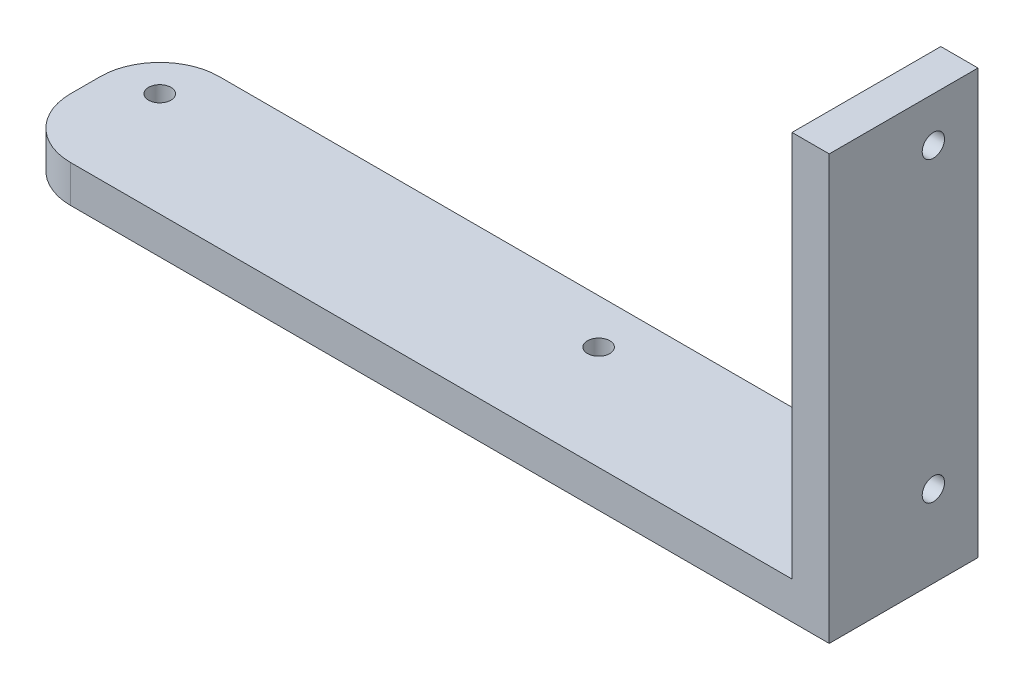
ISO-10303-21;
HEADER;
FILE_DESCRIPTION(('STEP AP214'),'2;1');
FILE_NAME('part.step','',(''),(''),'','','');
FILE_SCHEMA(('AUTOMOTIVE_DESIGN { 1 0 10303 214 1 1 1 1 }'));
ENDSEC;
DATA;
#1=APPLICATION_CONTEXT('core data for automotive mechanical design processes');
#2=APPLICATION_PROTOCOL_DEFINITION('international standard','automotive_design',2000,#1);
#3=PRODUCT_CONTEXT('',#1,'mechanical');
#4=PRODUCT('Part','Part','',(#3));
#5=PRODUCT_RELATED_PRODUCT_CATEGORY('part','',(#4));
#6=PRODUCT_DEFINITION_FORMATION('','',#4);
#7=PRODUCT_DEFINITION_CONTEXT('part definition',#1,'design');
#8=PRODUCT_DEFINITION('design','',#6,#7);
#9=PRODUCT_DEFINITION_SHAPE('','',#8);
#10=(LENGTH_UNIT() NAMED_UNIT(*) SI_UNIT(.MILLI.,.METRE.));
#11=(NAMED_UNIT(*) PLANE_ANGLE_UNIT() SI_UNIT($,.RADIAN.));
#12=(NAMED_UNIT(*) SI_UNIT($,.STERADIAN.) SOLID_ANGLE_UNIT());
#13=UNCERTAINTY_MEASURE_WITH_UNIT(LENGTH_MEASURE(1.E-05),#10,'distance_accuracy_value','');
#14=(GEOMETRIC_REPRESENTATION_CONTEXT(3) GLOBAL_UNCERTAINTY_ASSIGNED_CONTEXT((#13)) GLOBAL_UNIT_ASSIGNED_CONTEXT((#10,
#11,#12)) REPRESENTATION_CONTEXT('',''));
#15=CARTESIAN_POINT('',(0.,0.,0.));
#16=DIRECTION('',(0.,0.,1.));
#17=DIRECTION('',(1.,0.,0.));
#18=AXIS2_PLACEMENT_3D('',#15,#16,#17);
#19=CARTESIAN_POINT('',(0.,5.,0.));
#20=DIRECTION('',(0.,-1.,0.));
#21=DIRECTION('',(0.,0.,-1.));
#22=AXIS2_PLACEMENT_3D('',#19,#20,#21);
#23=PLANE('',#22);
#24=CARTESIAN_POINT('',(65.,5.,-14.));
#25=DIRECTION('',(0.,1.,0.));
#26=DIRECTION('',(0.,0.,1.));
#27=AXIS2_PLACEMENT_3D('',#24,#25,#26);
#28=CIRCLE('',#27,1.5);
#29=CARTESIAN_POINT('',(65.,5.,-12.5));
#30=VERTEX_POINT('',#29);
#31=EDGE_CURVE('E261',#30,#30,#28,.T.);
#32=ORIENTED_EDGE('',*,*,#31,.F.);
#33=EDGE_LOOP('',(#32));
#34=FACE_BOUND('',#33,.T.);
#35=CARTESIAN_POINT('',(6.00000000000001,5.,-14.));
#36=DIRECTION('',(0.,1.,0.));
#37=DIRECTION('',(0.,0.,1.));
#38=AXIS2_PLACEMENT_3D('',#35,#36,#37);
#39=CIRCLE('',#38,1.5);
#40=CARTESIAN_POINT('',(6.00000000000001,5.,-12.5));
#41=VERTEX_POINT('',#40);
#42=EDGE_CURVE('E132',#41,#41,#39,.T.);
#43=ORIENTED_EDGE('',*,*,#42,.F.);
#44=EDGE_LOOP('',(#43));
#45=FACE_BOUND('',#44,.T.);
#46=DIRECTION('',(-1.,0.,0.));
#47=VECTOR('',#46,1.);
#48=CARTESIAN_POINT('',(0.,5.,-20.));
#49=LINE('',#48,#47);
#50=CARTESIAN_POINT('',(105.,5.,-20.));
#51=VERTEX_POINT('',#50);
#52=CARTESIAN_POINT('',(8.,5.,-20.));
#53=VERTEX_POINT('',#52);
#54=EDGE_CURVE('E111',#51,#53,#49,.T.);
#55=ORIENTED_EDGE('',*,*,#54,.T.);
#56=CARTESIAN_POINT('',(8.,5.,-12.));
#57=DIRECTION('',(0.,-1.,0.));
#58=DIRECTION('',(0.,0.,-1.));
#59=AXIS2_PLACEMENT_3D('',#56,#57,#58);
#60=CIRCLE('',#59,8.);
#61=CARTESIAN_POINT('',(0.,5.,-12.));
#62=VERTEX_POINT('',#61);
#63=EDGE_CURVE('E41',#53,#62,#60,.F.);
#64=ORIENTED_EDGE('',*,*,#63,.T.);
#65=DIRECTION('',(0.,0.,1.));
#66=VECTOR('',#65,1.);
#67=CARTESIAN_POINT('',(0.,5.,0.));
#68=LINE('',#67,#66);
#69=CARTESIAN_POINT('',(0.,5.,-8.));
#70=VERTEX_POINT('',#69);
#71=EDGE_CURVE('E140',#62,#70,#68,.T.);
#72=ORIENTED_EDGE('',*,*,#71,.T.);
#73=CARTESIAN_POINT('',(8.,5.,-8.));
#74=DIRECTION('',(0.,-1.,0.));
#75=DIRECTION('',(0.,0.,-1.));
#76=AXIS2_PLACEMENT_3D('',#73,#74,#75);
#77=CIRCLE('',#76,8.);
#78=CARTESIAN_POINT('',(8.,5.,0.));
#79=VERTEX_POINT('',#78);
#80=EDGE_CURVE('E48',#70,#79,#77,.F.);
#81=ORIENTED_EDGE('',*,*,#80,.T.);
#82=DIRECTION('',(1.,0.,0.));
#83=VECTOR('',#82,1.);
#84=CARTESIAN_POINT('',(0.,5.,0.));
#85=LINE('',#84,#83);
#86=CARTESIAN_POINT('',(105.,5.,0.));
#87=VERTEX_POINT('',#86);
#88=EDGE_CURVE('E164',#79,#87,#85,.T.);
#89=ORIENTED_EDGE('',*,*,#88,.T.);
#90=DIRECTION('',(0.,0.,1.));
#91=VECTOR('',#90,1.);
#92=CARTESIAN_POINT('',(105.,5.,0.));
#93=LINE('',#92,#91);
#94=EDGE_CURVE('E126',#51,#87,#93,.T.);
#95=ORIENTED_EDGE('',*,*,#94,.F.);
#96=EDGE_LOOP('',(#55,#64,#72,#81,#89,#95));
#97=FACE_BOUND('',#96,.T.);
#98=ADVANCED_FACE('F33',(#34,#45,#97),#23,.F.);
#99=CARTESIAN_POINT('',(0.,5.,0.));
#100=DIRECTION('',(1.,0.,0.));
#101=DIRECTION('',(0.,0.,-1.));
#102=AXIS2_PLACEMENT_3D('',#99,#100,#101);
#103=PLANE('',#102);
#104=ORIENTED_EDGE('',*,*,#71,.F.);
#105=DIRECTION('',(0.,-1.,0.));
#106=VECTOR('',#105,1.);
#107=CARTESIAN_POINT('',(0.,5.,-12.));
#108=LINE('',#107,#106);
#109=CARTESIAN_POINT('',(0.,0.,-12.));
#110=VERTEX_POINT('',#109);
#111=EDGE_CURVE('E156',#62,#110,#108,.T.);
#112=ORIENTED_EDGE('',*,*,#111,.T.);
#113=DIRECTION('',(0.,0.,1.));
#114=VECTOR('',#113,1.);
#115=CARTESIAN_POINT('',(0.,0.,0.));
#116=LINE('',#115,#114);
#117=CARTESIAN_POINT('',(0.,0.,-8.));
#118=VERTEX_POINT('',#117);
#119=EDGE_CURVE('E151',#110,#118,#116,.T.);
#120=ORIENTED_EDGE('',*,*,#119,.T.);
#121=DIRECTION('',(0.,-1.,0.));
#122=VECTOR('',#121,1.);
#123=CARTESIAN_POINT('',(0.,5.,-8.));
#124=LINE('',#123,#122);
#125=EDGE_CURVE('E154',#118,#70,#124,.F.);
#126=ORIENTED_EDGE('',*,*,#125,.T.);
#127=EDGE_LOOP('',(#104,#112,#120,#126));
#128=FACE_BOUND('',#127,.T.);
#129=ADVANCED_FACE('F186',(#128),#103,.F.);
#130=CARTESIAN_POINT('',(0.,5.,0.));
#131=DIRECTION('',(0.,0.,-1.));
#132=DIRECTION('',(-1.,0.,0.));
#133=AXIS2_PLACEMENT_3D('',#130,#131,#132);
#134=PLANE('',#133);
#135=ORIENTED_EDGE('',*,*,#88,.F.);
#136=DIRECTION('',(0.,-1.,0.));
#137=VECTOR('',#136,1.);
#138=CARTESIAN_POINT('',(8.,5.,0.));
#139=LINE('',#138,#137);
#140=CARTESIAN_POINT('',(8.,0.,0.));
#141=VERTEX_POINT('',#140);
#142=EDGE_CURVE('E11',#79,#141,#139,.T.);
#143=ORIENTED_EDGE('',*,*,#142,.T.);
#144=DIRECTION('',(1.,0.,0.));
#145=VECTOR('',#144,1.);
#146=CARTESIAN_POINT('',(0.,0.,0.));
#147=LINE('',#146,#145);
#148=CARTESIAN_POINT('',(110.,0.,0.));
#149=VERTEX_POINT('',#148);
#150=EDGE_CURVE('E171',#141,#149,#147,.T.);
#151=ORIENTED_EDGE('',*,*,#150,.T.);
#152=DIRECTION('',(0.,-1.,0.));
#153=VECTOR('',#152,1.);
#154=CARTESIAN_POINT('',(110.,5.,0.));
#155=LINE('',#154,#153);
#156=CARTESIAN_POINT('',(110.,57.,0.));
#157=VERTEX_POINT('',#156);
#158=EDGE_CURVE('E110',#157,#149,#155,.T.);
#159=ORIENTED_EDGE('',*,*,#158,.F.);
#160=DIRECTION('',(1.,0.,0.));
#161=VECTOR('',#160,1.);
#162=CARTESIAN_POINT('',(110.,57.,0.));
#163=LINE('',#162,#161);
#164=CARTESIAN_POINT('',(105.,57.,0.));
#165=VERTEX_POINT('',#164);
#166=EDGE_CURVE('E125',#165,#157,#163,.T.);
#167=ORIENTED_EDGE('',*,*,#166,.F.);
#168=DIRECTION('',(0.,-1.,0.));
#169=VECTOR('',#168,1.);
#170=CARTESIAN_POINT('',(105.,57.,0.));
#171=LINE('',#170,#169);
#172=EDGE_CURVE('E137',#165,#87,#171,.T.);
#173=ORIENTED_EDGE('',*,*,#172,.T.);
#174=EDGE_LOOP('',(#135,#143,#151,#159,#167,#173));
#175=FACE_BOUND('',#174,.T.);
#176=ADVANCED_FACE('F190',(#175),#134,.F.);
#177=CARTESIAN_POINT('',(110.,5.,0.));
#178=DIRECTION('',(-1.,0.,0.));
#179=DIRECTION('',(0.,0.,1.));
#180=AXIS2_PLACEMENT_3D('',#177,#178,#179);
#181=PLANE('',#180);
#182=CARTESIAN_POINT('',(110.,51.,-14.));
#183=DIRECTION('',(-1.,0.,0.));
#184=DIRECTION('',(0.,0.,1.));
#185=AXIS2_PLACEMENT_3D('',#182,#183,#184);
#186=CIRCLE('',#185,1.5);
#187=CARTESIAN_POINT('',(110.,51.,-12.5));
#188=VERTEX_POINT('',#187);
#189=EDGE_CURVE('E251',#188,#188,#186,.T.);
#190=ORIENTED_EDGE('',*,*,#189,.T.);
#191=EDGE_LOOP('',(#190));
#192=FACE_BOUND('',#191,.T.);
#193=CARTESIAN_POINT('',(110.,11.,-14.));
#194=DIRECTION('',(-1.,0.,0.));
#195=DIRECTION('',(0.,0.,1.));
#196=AXIS2_PLACEMENT_3D('',#193,#194,#195);
#197=CIRCLE('',#196,1.5);
#198=CARTESIAN_POINT('',(110.,11.,-12.5));
#199=VERTEX_POINT('',#198);
#200=EDGE_CURVE('E258',#199,#199,#197,.T.);
#201=ORIENTED_EDGE('',*,*,#200,.T.);
#202=EDGE_LOOP('',(#201));
#203=FACE_BOUND('',#202,.T.);
#204=DIRECTION('',(0.,0.,-1.));
#205=VECTOR('',#204,1.);
#206=CARTESIAN_POINT('',(110.,0.,0.));
#207=LINE('',#206,#205);
#208=CARTESIAN_POINT('',(110.,0.,-20.));
#209=VERTEX_POINT('',#208);
#210=EDGE_CURVE('E108',#149,#209,#207,.T.);
#211=ORIENTED_EDGE('',*,*,#210,.T.);
#212=DIRECTION('',(0.,-1.,0.));
#213=VECTOR('',#212,1.);
#214=CARTESIAN_POINT('',(110.,5.,-20.));
#215=LINE('',#214,#213);
#216=CARTESIAN_POINT('',(110.,57.,-20.));
#217=VERTEX_POINT('',#216);
#218=EDGE_CURVE('E101',#217,#209,#215,.T.);
#219=ORIENTED_EDGE('',*,*,#218,.F.);
#220=DIRECTION('',(0.,0.,-1.));
#221=VECTOR('',#220,1.);
#222=CARTESIAN_POINT('',(110.,57.,0.));
#223=LINE('',#222,#221);
#224=EDGE_CURVE('E106',#157,#217,#223,.T.);
#225=ORIENTED_EDGE('',*,*,#224,.F.);
#226=ORIENTED_EDGE('',*,*,#158,.T.);
#227=EDGE_LOOP('',(#211,#219,#225,#226));
#228=FACE_BOUND('',#227,.T.);
#229=ADVANCED_FACE('F103',(#192,#203,#228),#181,.F.);
#230=CARTESIAN_POINT('',(0.,5.,-20.));
#231=DIRECTION('',(0.,0.,1.));
#232=DIRECTION('',(1.,0.,0.));
#233=AXIS2_PLACEMENT_3D('',#230,#231,#232);
#234=PLANE('',#233);
#235=DIRECTION('',(-1.,0.,0.));
#236=VECTOR('',#235,1.);
#237=CARTESIAN_POINT('',(0.,0.,-20.));
#238=LINE('',#237,#236);
#239=CARTESIAN_POINT('',(8.,0.,-20.));
#240=VERTEX_POINT('',#239);
#241=EDGE_CURVE('E174',#209,#240,#238,.T.);
#242=ORIENTED_EDGE('',*,*,#241,.T.);
#243=DIRECTION('',(0.,-1.,0.));
#244=VECTOR('',#243,1.);
#245=CARTESIAN_POINT('',(8.,5.,-20.));
#246=LINE('',#245,#244);
#247=EDGE_CURVE('E56',#240,#53,#246,.F.);
#248=ORIENTED_EDGE('',*,*,#247,.T.);
#249=ORIENTED_EDGE('',*,*,#54,.F.);
#250=DIRECTION('',(0.,-1.,0.));
#251=VECTOR('',#250,1.);
#252=CARTESIAN_POINT('',(105.,57.,-20.));
#253=LINE('',#252,#251);
#254=CARTESIAN_POINT('',(105.,57.,-20.));
#255=VERTEX_POINT('',#254);
#256=EDGE_CURVE('E117',#255,#51,#253,.T.);
#257=ORIENTED_EDGE('',*,*,#256,.F.);
#258=DIRECTION('',(-1.,0.,0.));
#259=VECTOR('',#258,1.);
#260=CARTESIAN_POINT('',(110.,57.,-20.));
#261=LINE('',#260,#259);
#262=EDGE_CURVE('E114',#217,#255,#261,.T.);
#263=ORIENTED_EDGE('',*,*,#262,.F.);
#264=ORIENTED_EDGE('',*,*,#218,.T.);
#265=EDGE_LOOP('',(#242,#248,#249,#257,#263,#264));
#266=FACE_BOUND('',#265,.T.);
#267=ADVANCED_FACE('F115',(#266),#234,.F.);
#268=CARTESIAN_POINT('',(0.,0.,0.));
#269=DIRECTION('',(0.,-1.,0.));
#270=DIRECTION('',(0.,0.,-1.));
#271=AXIS2_PLACEMENT_3D('',#268,#269,#270);
#272=PLANE('',#271);
#273=CARTESIAN_POINT('',(65.,0.,-14.));
#274=DIRECTION('',(0.,1.,0.));
#275=DIRECTION('',(0.,0.,1.));
#276=AXIS2_PLACEMENT_3D('',#273,#274,#275);
#277=CIRCLE('',#276,1.5);
#278=CARTESIAN_POINT('',(65.,0.,-12.5));
#279=VERTEX_POINT('',#278);
#280=EDGE_CURVE('E264',#279,#279,#277,.T.);
#281=ORIENTED_EDGE('',*,*,#280,.T.);
#282=EDGE_LOOP('',(#281));
#283=FACE_BOUND('',#282,.T.);
#284=CARTESIAN_POINT('',(6.00000000000001,0.,-14.));
#285=DIRECTION('',(0.,1.,0.));
#286=DIRECTION('',(0.,0.,1.));
#287=AXIS2_PLACEMENT_3D('',#284,#285,#286);
#288=CIRCLE('',#287,1.5);
#289=CARTESIAN_POINT('',(6.00000000000001,0.,-12.5));
#290=VERTEX_POINT('',#289);
#291=EDGE_CURVE('E129',#290,#290,#288,.T.);
#292=ORIENTED_EDGE('',*,*,#291,.T.);
#293=EDGE_LOOP('',(#292));
#294=FACE_BOUND('',#293,.T.);
#295=ORIENTED_EDGE('',*,*,#119,.F.);
#296=CARTESIAN_POINT('',(8.,0.,-12.));
#297=DIRECTION('',(0.,-1.,0.));
#298=DIRECTION('',(0.,0.,-1.));
#299=AXIS2_PLACEMENT_3D('',#296,#297,#298);
#300=CIRCLE('',#299,8.);
#301=EDGE_CURVE('E161',#110,#240,#300,.T.);
#302=ORIENTED_EDGE('',*,*,#301,.T.);
#303=ORIENTED_EDGE('',*,*,#241,.F.);
#304=ORIENTED_EDGE('',*,*,#210,.F.);
#305=ORIENTED_EDGE('',*,*,#150,.F.);
#306=CARTESIAN_POINT('',(8.,0.,-8.));
#307=DIRECTION('',(0.,-1.,0.));
#308=DIRECTION('',(0.,0.,-1.));
#309=AXIS2_PLACEMENT_3D('',#306,#307,#308);
#310=CIRCLE('',#309,8.);
#311=EDGE_CURVE('E159',#141,#118,#310,.T.);
#312=ORIENTED_EDGE('',*,*,#311,.T.);
#313=EDGE_LOOP('',(#295,#302,#303,#304,#305,#312));
#314=FACE_BOUND('',#313,.T.);
#315=ADVANCED_FACE('F179',(#283,#294,#314),#272,.T.);
#316=CARTESIAN_POINT('',(105.,57.,0.));
#317=DIRECTION('',(1.,0.,0.));
#318=DIRECTION('',(0.,0.,-1.));
#319=AXIS2_PLACEMENT_3D('',#316,#317,#318);
#320=PLANE('',#319);
#321=CARTESIAN_POINT('',(105.,51.,-14.));
#322=DIRECTION('',(-1.,0.,0.));
#323=DIRECTION('',(0.,0.,1.));
#324=AXIS2_PLACEMENT_3D('',#321,#322,#323);
#325=CIRCLE('',#324,1.5);
#326=CARTESIAN_POINT('',(105.,51.,-12.5));
#327=VERTEX_POINT('',#326);
#328=EDGE_CURVE('E253',#327,#327,#325,.T.);
#329=ORIENTED_EDGE('',*,*,#328,.F.);
#330=EDGE_LOOP('',(#329));
#331=FACE_BOUND('',#330,.T.);
#332=CARTESIAN_POINT('',(105.,11.,-14.));
#333=DIRECTION('',(-1.,0.,0.));
#334=DIRECTION('',(0.,0.,1.));
#335=AXIS2_PLACEMENT_3D('',#332,#333,#334);
#336=CIRCLE('',#335,1.5);
#337=CARTESIAN_POINT('',(105.,11.,-12.5));
#338=VERTEX_POINT('',#337);
#339=EDGE_CURVE('E255',#338,#338,#336,.T.);
#340=ORIENTED_EDGE('',*,*,#339,.F.);
#341=EDGE_LOOP('',(#340));
#342=FACE_BOUND('',#341,.T.);
#343=ORIENTED_EDGE('',*,*,#94,.T.);
#344=ORIENTED_EDGE('',*,*,#172,.F.);
#345=DIRECTION('',(0.,0.,1.));
#346=VECTOR('',#345,1.);
#347=CARTESIAN_POINT('',(105.,57.,0.));
#348=LINE('',#347,#346);
#349=EDGE_CURVE('E120',#255,#165,#348,.T.);
#350=ORIENTED_EDGE('',*,*,#349,.F.);
#351=ORIENTED_EDGE('',*,*,#256,.T.);
#352=EDGE_LOOP('',(#343,#344,#350,#351));
#353=FACE_BOUND('',#352,.T.);
#354=ADVANCED_FACE('F193',(#331,#342,#353),#320,.F.);
#355=CARTESIAN_POINT('',(0.,57.,0.));
#356=DIRECTION('',(0.,1.,0.));
#357=DIRECTION('',(0.,0.,1.));
#358=AXIS2_PLACEMENT_3D('',#355,#356,#357);
#359=PLANE('',#358);
#360=ORIENTED_EDGE('',*,*,#224,.T.);
#361=ORIENTED_EDGE('',*,*,#262,.T.);
#362=ORIENTED_EDGE('',*,*,#349,.T.);
#363=ORIENTED_EDGE('',*,*,#166,.T.);
#364=EDGE_LOOP('',(#360,#361,#362,#363));
#365=FACE_BOUND('',#364,.T.);
#366=ADVANCED_FACE('F123',(#365),#359,.T.);
#367=CARTESIAN_POINT('',(6.00000000000001,0.,-14.));
#368=DIRECTION('',(0.,1.,0.));
#369=DIRECTION('',(0.,0.,1.));
#370=AXIS2_PLACEMENT_3D('',#367,#368,#369);
#371=CYLINDRICAL_SURFACE('',#370,1.5);
#372=ORIENTED_EDGE('',*,*,#291,.F.);
#373=EDGE_LOOP('',(#372));
#374=FACE_BOUND('',#373,.T.);
#375=ORIENTED_EDGE('',*,*,#42,.T.);
#376=EDGE_LOOP('',(#375));
#377=FACE_BOUND('',#376,.T.);
#378=ADVANCED_FACE('F201',(#374,#377),#371,.F.);
#379=CARTESIAN_POINT('',(65.,0.,-14.));
#380=DIRECTION('',(0.,1.,0.));
#381=DIRECTION('',(0.,0.,1.));
#382=AXIS2_PLACEMENT_3D('',#379,#380,#381);
#383=CYLINDRICAL_SURFACE('',#382,1.5);
#384=ORIENTED_EDGE('',*,*,#280,.F.);
#385=EDGE_LOOP('',(#384));
#386=FACE_BOUND('',#385,.T.);
#387=ORIENTED_EDGE('',*,*,#31,.T.);
#388=EDGE_LOOP('',(#387));
#389=FACE_BOUND('',#388,.T.);
#390=ADVANCED_FACE('F224',(#386,#389),#383,.F.);
#391=CARTESIAN_POINT('',(8.,5.,-12.));
#392=DIRECTION('',(0.,-1.,0.));
#393=DIRECTION('',(0.,0.,-1.));
#394=AXIS2_PLACEMENT_3D('',#391,#392,#393);
#395=CYLINDRICAL_SURFACE('',#394,8.);
#396=ORIENTED_EDGE('',*,*,#63,.F.);
#397=ORIENTED_EDGE('',*,*,#247,.F.);
#398=ORIENTED_EDGE('',*,*,#301,.F.);
#399=ORIENTED_EDGE('',*,*,#111,.F.);
#400=EDGE_LOOP('',(#396,#397,#398,#399));
#401=FACE_BOUND('',#400,.T.);
#402=ADVANCED_FACE('F182',(#401),#395,.T.);
#403=CARTESIAN_POINT('',(8.,5.,-8.));
#404=DIRECTION('',(0.,-1.,0.));
#405=DIRECTION('',(0.,0.,-1.));
#406=AXIS2_PLACEMENT_3D('',#403,#404,#405);
#407=CYLINDRICAL_SURFACE('',#406,8.);
#408=ORIENTED_EDGE('',*,*,#80,.F.);
#409=ORIENTED_EDGE('',*,*,#125,.F.);
#410=ORIENTED_EDGE('',*,*,#311,.F.);
#411=ORIENTED_EDGE('',*,*,#142,.F.);
#412=EDGE_LOOP('',(#408,#409,#410,#411));
#413=FACE_BOUND('',#412,.T.);
#414=ADVANCED_FACE('F35',(#413),#407,.T.);
#415=CARTESIAN_POINT('',(110.,11.,-14.));
#416=DIRECTION('',(-1.,0.,0.));
#417=DIRECTION('',(0.,0.,1.));
#418=AXIS2_PLACEMENT_3D('',#415,#416,#417);
#419=CYLINDRICAL_SURFACE('',#418,1.5);
#420=ORIENTED_EDGE('',*,*,#200,.F.);
#421=EDGE_LOOP('',(#420));
#422=FACE_BOUND('',#421,.T.);
#423=ORIENTED_EDGE('',*,*,#339,.T.);
#424=EDGE_LOOP('',(#423));
#425=FACE_BOUND('',#424,.T.);
#426=ADVANCED_FACE('F229',(#422,#425),#419,.F.);
#427=CARTESIAN_POINT('',(110.,51.,-14.));
#428=DIRECTION('',(-1.,0.,0.));
#429=DIRECTION('',(0.,0.,1.));
#430=AXIS2_PLACEMENT_3D('',#427,#428,#429);
#431=CYLINDRICAL_SURFACE('',#430,1.5);
#432=ORIENTED_EDGE('',*,*,#189,.F.);
#433=EDGE_LOOP('',(#432));
#434=FACE_BOUND('',#433,.T.);
#435=ORIENTED_EDGE('',*,*,#328,.T.);
#436=EDGE_LOOP('',(#435));
#437=FACE_BOUND('',#436,.T.);
#438=ADVANCED_FACE('F242',(#434,#437),#431,.F.);
#439=CLOSED_SHELL('',(#98,#129,#176,#229,#267,#315,#354,#366,#378,#390,#402,#414,#426,#438));
#440=MANIFOLD_SOLID_BREP('B2',#439);
#441=ADVANCED_BREP_SHAPE_REPRESENTATION('',(#18,#440),#14);
#442=SHAPE_DEFINITION_REPRESENTATION(#9,#441);
ENDSEC;
END-ISO-10303-21;
